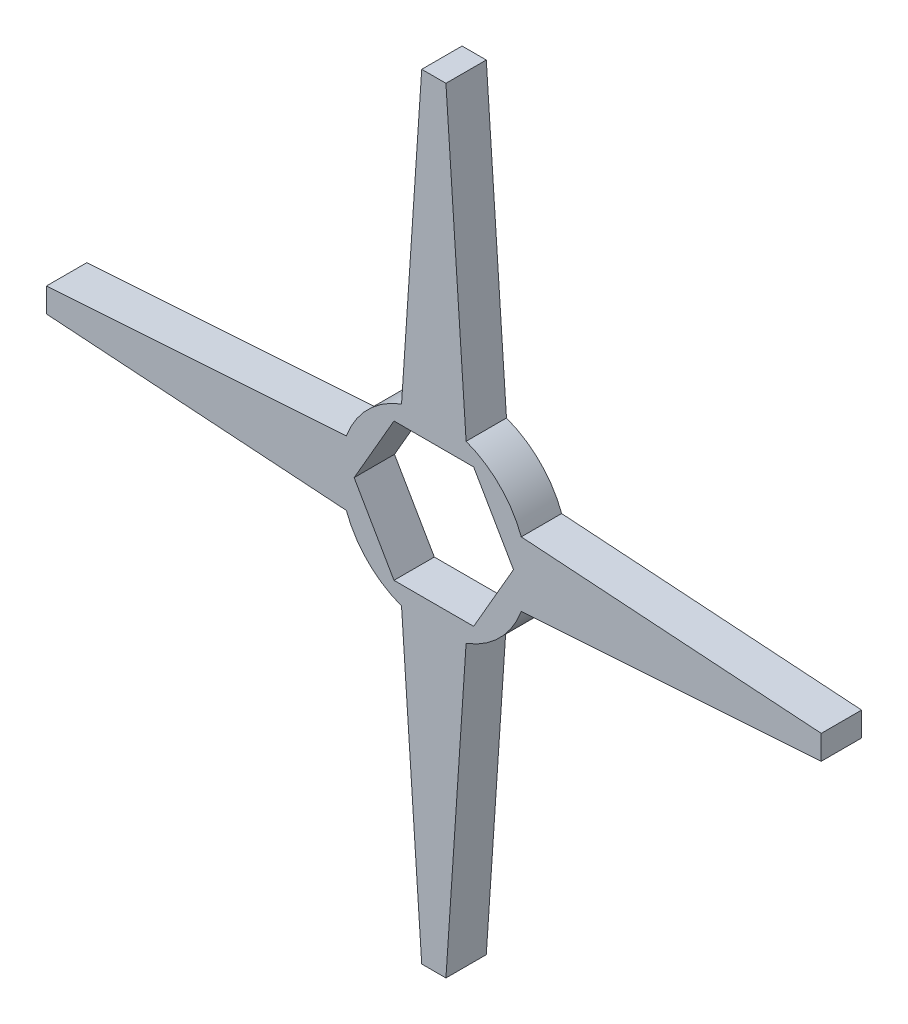
ISO-10303-21;
HEADER;
FILE_DESCRIPTION(('STEP AP214'),'2;1');
FILE_NAME('part.step','',(''),(''),'','','');
FILE_SCHEMA(('AUTOMOTIVE_DESIGN { 1 0 10303 214 1 1 1 1 }'));
ENDSEC;
DATA;
#1=APPLICATION_CONTEXT('core data for automotive mechanical design processes');
#2=APPLICATION_PROTOCOL_DEFINITION('international standard','automotive_design',2000,#1);
#3=PRODUCT_CONTEXT('',#1,'mechanical');
#4=PRODUCT('Part','Part','',(#3));
#5=PRODUCT_RELATED_PRODUCT_CATEGORY('part','',(#4));
#6=PRODUCT_DEFINITION_FORMATION('','',#4);
#7=PRODUCT_DEFINITION_CONTEXT('part definition',#1,'design');
#8=PRODUCT_DEFINITION('design','',#6,#7);
#9=PRODUCT_DEFINITION_SHAPE('','',#8);
#10=(LENGTH_UNIT() NAMED_UNIT(*) SI_UNIT(.MILLI.,.METRE.));
#11=(NAMED_UNIT(*) PLANE_ANGLE_UNIT() SI_UNIT($,.RADIAN.));
#12=(NAMED_UNIT(*) SI_UNIT($,.STERADIAN.) SOLID_ANGLE_UNIT());
#13=UNCERTAINTY_MEASURE_WITH_UNIT(LENGTH_MEASURE(1.E-05),#10,'distance_accuracy_value','');
#14=(GEOMETRIC_REPRESENTATION_CONTEXT(3) GLOBAL_UNCERTAINTY_ASSIGNED_CONTEXT((#13)) GLOBAL_UNIT_ASSIGNED_CONTEXT((#10,
#11,#12)) REPRESENTATION_CONTEXT('',''));
#15=CARTESIAN_POINT('',(0.,0.,0.));
#16=DIRECTION('',(0.,0.,1.));
#17=DIRECTION('',(1.,0.,0.));
#18=AXIS2_PLACEMENT_3D('',#15,#16,#17);
#19=CARTESIAN_POINT('',(-4.93634480157135,-8.55000000000012,5.));
#20=DIRECTION('',(0.,1.,0.));
#21=DIRECTION('',(1.00000000000001,0.,0.));
#22=AXIS2_PLACEMENT_3D('',#19,#20,#21);
#23=PLANE('',#22);
#24=DIRECTION('',(0.,0.,0.999999999999991));
#25=VECTOR('',#24,1.);
#26=CARTESIAN_POINT('',(4.93634480157164,-8.55000000000003,5.));
#27=LINE('',#26,#25);
#28=CARTESIAN_POINT('',(4.93634480157174,-8.55000000000005,0.));
#29=VERTEX_POINT('',#28);
#30=CARTESIAN_POINT('',(4.93634480157164,-8.55000000000003,5.));
#31=VERTEX_POINT('',#30);
#32=EDGE_CURVE('E11',#29,#31,#27,.T.);
#33=ORIENTED_EDGE('',*,*,#32,.F.);
#34=DIRECTION('',(-1.00000000000001,0.,0.));
#35=VECTOR('',#34,1.);
#36=CARTESIAN_POINT('',(0.,-8.55000000000014,0.));
#37=LINE('',#36,#35);
#38=CARTESIAN_POINT('',(-4.93634480157144,-8.55000000000014,0.));
#39=VERTEX_POINT('',#38);
#40=EDGE_CURVE('E151',#39,#29,#37,.F.);
#41=ORIENTED_EDGE('',*,*,#40,.F.);
#42=DIRECTION('',(0.,0.,0.999999999999991));
#43=VECTOR('',#42,1.);
#44=CARTESIAN_POINT('',(-4.93634480157135,-8.55000000000012,5.));
#45=LINE('',#44,#43);
#46=CARTESIAN_POINT('',(-4.93634480157135,-8.55000000000012,5.));
#47=VERTEX_POINT('',#46);
#48=EDGE_CURVE('E51',#39,#47,#45,.T.);
#49=ORIENTED_EDGE('',*,*,#48,.T.);
#50=DIRECTION('',(1.00000000000001,0.,0.));
#51=VECTOR('',#50,1.);
#52=CARTESIAN_POINT('',(-4.93634480157135,-8.55000000000012,5.));
#53=LINE('',#52,#51);
#54=EDGE_CURVE('E230',#47,#31,#53,.T.);
#55=ORIENTED_EDGE('',*,*,#54,.T.);
#56=EDGE_LOOP('',(#33,#41,#49,#55));
#57=FACE_BOUND('',#56,.T.);
#58=ADVANCED_FACE('F41',(#57),#23,.T.);
#59=CARTESIAN_POINT('',(-9.87268960314308,0.,5.));
#60=DIRECTION('',(0.866025403784439,0.5,0.));
#61=DIRECTION('',(0.500000000000005,-0.866025403784448,0.));
#62=AXIS2_PLACEMENT_3D('',#59,#60,#61);
#63=PLANE('',#62);
#64=ORIENTED_EDGE('',*,*,#48,.F.);
#65=DIRECTION('',(0.500000000000005,-0.866025403784448,0.));
#66=VECTOR('',#65,1.);
#67=CARTESIAN_POINT('',(-9.87268960314308,0.,1.34441069388203E-13));
#68=LINE('',#67,#66);
#69=CARTESIAN_POINT('',(-9.87268960314328,0.,0.));
#70=VERTEX_POINT('',#69);
#71=EDGE_CURVE('E169',#70,#39,#68,.T.);
#72=ORIENTED_EDGE('',*,*,#71,.F.);
#73=DIRECTION('',(0.,0.,0.999999999999991));
#74=VECTOR('',#73,1.);
#75=CARTESIAN_POINT('',(-9.87268960314308,0.,5.));
#76=LINE('',#75,#74);
#77=CARTESIAN_POINT('',(-9.87268960314308,0.,5.));
#78=VERTEX_POINT('',#77);
#79=EDGE_CURVE('E223',#70,#78,#76,.T.);
#80=ORIENTED_EDGE('',*,*,#79,.T.);
#81=DIRECTION('',(0.500000000000005,-0.866025403784448,0.));
#82=VECTOR('',#81,1.);
#83=CARTESIAN_POINT('',(-9.87268960314308,0.,5.));
#84=LINE('',#83,#82);
#85=EDGE_CURVE('E239',#78,#47,#84,.T.);
#86=ORIENTED_EDGE('',*,*,#85,.T.);
#87=EDGE_LOOP('',(#64,#72,#80,#86));
#88=FACE_BOUND('',#87,.T.);
#89=ADVANCED_FACE('F242',(#88),#63,.T.);
#90=CARTESIAN_POINT('',(-4.93634480157124,8.55000000000005,5.));
#91=DIRECTION('',(0.866025403784439,-0.5,0.));
#92=DIRECTION('',(-0.500000000000006,-0.866025403784448,0.));
#93=AXIS2_PLACEMENT_3D('',#90,#91,#92);
#94=PLANE('',#93);
#95=ORIENTED_EDGE('',*,*,#79,.F.);
#96=DIRECTION('',(-0.500000000000006,-0.866025403784448,0.));
#97=VECTOR('',#96,1.);
#98=CARTESIAN_POINT('',(-4.93634480157123,8.55000000000005,1.34441069388203E-13));
#99=LINE('',#98,#97);
#100=CARTESIAN_POINT('',(-4.93634480157133,8.55000000000006,0.));
#101=VERTEX_POINT('',#100);
#102=EDGE_CURVE('E166',#101,#70,#99,.T.);
#103=ORIENTED_EDGE('',*,*,#102,.F.);
#104=DIRECTION('',(0.,0.,0.999999999999991));
#105=VECTOR('',#104,1.);
#106=CARTESIAN_POINT('',(-4.93634480157124,8.55000000000005,5.));
#107=LINE('',#106,#105);
#108=CARTESIAN_POINT('',(-4.93634480157124,8.55000000000005,5.));
#109=VERTEX_POINT('',#108);
#110=EDGE_CURVE('E221',#101,#109,#107,.T.);
#111=ORIENTED_EDGE('',*,*,#110,.T.);
#112=DIRECTION('',(-0.500000000000006,-0.866025403784448,0.));
#113=VECTOR('',#112,1.);
#114=CARTESIAN_POINT('',(-4.93634480157124,8.55000000000005,5.));
#115=LINE('',#114,#113);
#116=EDGE_CURVE('E243',#109,#78,#115,.T.);
#117=ORIENTED_EDGE('',*,*,#116,.T.);
#118=EDGE_LOOP('',(#95,#103,#111,#117));
#119=FACE_BOUND('',#118,.T.);
#120=ADVANCED_FACE('F397',(#119),#94,.T.);
#121=CARTESIAN_POINT('',(4.9363448015713,8.55000000000004,5.));
#122=DIRECTION('',(0.,-1.,0.));
#123=DIRECTION('',(-1.00000000000001,0.,0.));
#124=AXIS2_PLACEMENT_3D('',#121,#122,#123);
#125=PLANE('',#124);
#126=ORIENTED_EDGE('',*,*,#110,.F.);
#127=DIRECTION('',(-1.00000000000001,0.,0.));
#128=VECTOR('',#127,1.);
#129=CARTESIAN_POINT('',(0.,8.55000000000006,0.));
#130=LINE('',#129,#128);
#131=CARTESIAN_POINT('',(4.9363448015714,8.55000000000006,0.));
#132=VERTEX_POINT('',#131);
#133=EDGE_CURVE('E163',#132,#101,#130,.T.);
#134=ORIENTED_EDGE('',*,*,#133,.F.);
#135=DIRECTION('',(0.,0.,0.999999999999991));
#136=VECTOR('',#135,1.);
#137=CARTESIAN_POINT('',(4.9363448015713,8.55000000000004,5.));
#138=LINE('',#137,#136);
#139=CARTESIAN_POINT('',(4.9363448015713,8.55000000000004,5.));
#140=VERTEX_POINT('',#139);
#141=EDGE_CURVE('E59',#132,#140,#138,.T.);
#142=ORIENTED_EDGE('',*,*,#141,.T.);
#143=DIRECTION('',(-1.00000000000001,0.,0.));
#144=VECTOR('',#143,1.);
#145=CARTESIAN_POINT('',(4.9363448015713,8.55000000000004,5.));
#146=LINE('',#145,#144);
#147=EDGE_CURVE('E219',#140,#109,#146,.T.);
#148=ORIENTED_EDGE('',*,*,#147,.T.);
#149=EDGE_LOOP('',(#126,#134,#142,#148));
#150=FACE_BOUND('',#149,.T.);
#151=ADVANCED_FACE('F394',(#150),#125,.T.);
#152=CARTESIAN_POINT('',(9.87268960314271,0.,5.));
#153=DIRECTION('',(-0.866025403784439,-0.5,0.));
#154=DIRECTION('',(-0.500000000000006,0.866025403784448,0.));
#155=AXIS2_PLACEMENT_3D('',#152,#153,#154);
#156=PLANE('',#155);
#157=ORIENTED_EDGE('',*,*,#141,.F.);
#158=DIRECTION('',(-0.500000000000006,0.866025403784448,0.));
#159=VECTOR('',#158,1.);
#160=CARTESIAN_POINT('',(9.87268960314271,0.,1.34441069388203E-13));
#161=LINE('',#160,#159);
#162=CARTESIAN_POINT('',(9.8726896031429,0.,0.));
#163=VERTEX_POINT('',#162);
#164=EDGE_CURVE('E149',#163,#132,#161,.T.);
#165=ORIENTED_EDGE('',*,*,#164,.F.);
#166=DIRECTION('',(0.,0.,0.999999999999991));
#167=VECTOR('',#166,1.);
#168=CARTESIAN_POINT('',(9.87268960314271,0.,5.));
#169=LINE('',#168,#167);
#170=CARTESIAN_POINT('',(9.87268960314271,0.,5.));
#171=VERTEX_POINT('',#170);
#172=EDGE_CURVE('E45',#163,#171,#169,.T.);
#173=ORIENTED_EDGE('',*,*,#172,.T.);
#174=DIRECTION('',(-0.500000000000006,0.866025403784448,0.));
#175=VECTOR('',#174,1.);
#176=CARTESIAN_POINT('',(9.87268960314271,0.,5.));
#177=LINE('',#176,#175);
#178=EDGE_CURVE('E392',#171,#140,#177,.T.);
#179=ORIENTED_EDGE('',*,*,#178,.T.);
#180=EDGE_LOOP('',(#157,#165,#173,#179));
#181=FACE_BOUND('',#180,.T.);
#182=ADVANCED_FACE('F153',(#181),#156,.T.);
#183=CARTESIAN_POINT('',(-1.49999999999983,48.0000000000004,5.));
#184=DIRECTION('',(0.,-1.,0.));
#185=DIRECTION('',(-1.00000000000001,0.,0.));
#186=AXIS2_PLACEMENT_3D('',#183,#184,#185);
#187=PLANE('',#186);
#188=DIRECTION('',(0.,0.,0.999999999999991));
#189=VECTOR('',#188,1.);
#190=CARTESIAN_POINT('',(1.50000000000006,48.0000000000004,5.));
#191=LINE('',#190,#189);
#192=CARTESIAN_POINT('',(1.50000000000009,48.0000000000005,0.));
#193=VERTEX_POINT('',#192);
#194=CARTESIAN_POINT('',(1.50000000000006,48.0000000000004,5.));
#195=VERTEX_POINT('',#194);
#196=EDGE_CURVE('E144',#193,#195,#191,.T.);
#197=ORIENTED_EDGE('',*,*,#196,.F.);
#198=DIRECTION('',(-1.00000000000001,0.,0.));
#199=VECTOR('',#198,1.);
#200=CARTESIAN_POINT('',(0.,48.0000000000005,0.));
#201=LINE('',#200,#199);
#202=CARTESIAN_POINT('',(-1.49999999999986,48.0000000000005,0.));
#203=VERTEX_POINT('',#202);
#204=EDGE_CURVE('E286',#193,#203,#201,.T.);
#205=ORIENTED_EDGE('',*,*,#204,.T.);
#206=DIRECTION('',(0.,0.,0.999999999999991));
#207=VECTOR('',#206,1.);
#208=CARTESIAN_POINT('',(-1.49999999999983,48.0000000000004,5.));
#209=LINE('',#208,#207);
#210=CARTESIAN_POINT('',(-1.49999999999983,48.0000000000004,5.));
#211=VERTEX_POINT('',#210);
#212=EDGE_CURVE('E212',#203,#211,#209,.T.);
#213=ORIENTED_EDGE('',*,*,#212,.T.);
#214=DIRECTION('',(-1.00000000000001,0.,0.));
#215=VECTOR('',#214,1.);
#216=CARTESIAN_POINT('',(-1.49999999999983,48.0000000000004,5.));
#217=LINE('',#216,#215);
#218=EDGE_CURVE('E345',#195,#211,#217,.T.);
#219=ORIENTED_EDGE('',*,*,#218,.F.);
#220=EDGE_LOOP('',(#197,#205,#213,#219));
#221=FACE_BOUND('',#220,.T.);
#222=ADVANCED_FACE('F344',(#221),#187,.F.);
#223=CARTESIAN_POINT('',(-1.49999999999983,48.0000000000004,5.));
#224=DIRECTION('',(0.99774515547767,-0.0671163521121346,0.));
#225=DIRECTION('',(-0.0671163521121352,-0.997745155477679,0.));
#226=AXIS2_PLACEMENT_3D('',#223,#224,#225);
#227=PLANE('',#226);
#228=ORIENTED_EDGE('',*,*,#212,.F.);
#229=DIRECTION('',(-0.0671163521121352,-0.997745155477679,0.));
#230=VECTOR('',#229,1.);
#231=CARTESIAN_POINT('',(-1.49999999999983,48.0000000000004,1.34441069388203E-13));
#232=LINE('',#231,#230);
#233=CARTESIAN_POINT('',(-3.99999999999992,10.8352434213532,1.36451212011646E-13));
#234=VERTEX_POINT('',#233);
#235=EDGE_CURVE('E284',#203,#234,#232,.T.);
#236=ORIENTED_EDGE('',*,*,#235,.T.);
#237=DIRECTION('',(0.,0.,0.999999999999991));
#238=VECTOR('',#237,1.);
#239=CARTESIAN_POINT('',(-4.00000000000006,10.8352434213543,5.));
#240=LINE('',#239,#238);
#241=CARTESIAN_POINT('',(-4.00000000000006,10.8352434213543,5.));
#242=VERTEX_POINT('',#241);
#243=EDGE_CURVE('E209',#234,#242,#240,.T.);
#244=ORIENTED_EDGE('',*,*,#243,.T.);
#245=DIRECTION('',(-0.0671163521121352,-0.997745155477679,0.));
#246=VECTOR('',#245,1.);
#247=CARTESIAN_POINT('',(-1.49999999999983,48.0000000000004,5.));
#248=LINE('',#247,#246);
#249=EDGE_CURVE('E351',#211,#242,#248,.T.);
#250=ORIENTED_EDGE('',*,*,#249,.F.);
#251=EDGE_LOOP('',(#228,#236,#244,#250));
#252=FACE_BOUND('',#251,.T.);
#253=ADVANCED_FACE('F355',(#252),#227,.F.);
#254=CARTESIAN_POINT('',(0.,0.,5.));
#255=DIRECTION('',(0.,0.,-0.999999999999991));
#256=DIRECTION('',(0.,1.,0.));
#257=AXIS2_PLACEMENT_3D('',#254,#255,#256);
#258=CYLINDRICAL_SURFACE('',#257,11.5499999999989);
#259=ORIENTED_EDGE('',*,*,#243,.F.);
#260=CARTESIAN_POINT('',(0.,0.,1.34441069388203E-13));
#261=DIRECTION('',(0.,0.,0.999999999999991));
#262=DIRECTION('',(0.,-1.,0.));
#263=AXIS2_PLACEMENT_3D('',#260,#261,#262);
#264=CIRCLE('',#263,11.5499999999989);
#265=CARTESIAN_POINT('',(-10.8352434213538,3.99999999999822,1.34224194791197E-13));
#266=VERTEX_POINT('',#265);
#267=EDGE_CURVE('E281',#234,#266,#264,.T.);
#268=ORIENTED_EDGE('',*,*,#267,.T.);
#269=DIRECTION('',(0.,0.,0.999999999999991));
#270=VECTOR('',#269,1.);
#271=CARTESIAN_POINT('',(-10.8352434213536,3.99999999999869,5.));
#272=LINE('',#271,#270);
#273=CARTESIAN_POINT('',(-10.8352434213536,3.99999999999869,5.));
#274=VERTEX_POINT('',#273);
#275=EDGE_CURVE('E206',#266,#274,#272,.T.);
#276=ORIENTED_EDGE('',*,*,#275,.T.);
#277=CARTESIAN_POINT('',(0.,0.,5.));
#278=DIRECTION('',(0.,0.,0.999999999999991));
#279=DIRECTION('',(-1.00000000000001,0.,0.));
#280=AXIS2_PLACEMENT_3D('',#277,#278,#279);
#281=CIRCLE('',#280,11.5499999999989);
#282=EDGE_CURVE('E356',#242,#274,#281,.T.);
#283=ORIENTED_EDGE('',*,*,#282,.F.);
#284=EDGE_LOOP('',(#259,#268,#276,#283));
#285=FACE_BOUND('',#284,.T.);
#286=ADVANCED_FACE('F454',(#285),#258,.T.);
#287=CARTESIAN_POINT('',(-48.0000000000004,1.49999999999996,5.));
#288=DIRECTION('',(0.0671163521120866,-0.997745155477673,0.));
#289=DIRECTION('',(-0.997745155477683,-0.0671163521120873,0.));
#290=AXIS2_PLACEMENT_3D('',#287,#288,#289);
#291=PLANE('',#290);
#292=ORIENTED_EDGE('',*,*,#275,.F.);
#293=DIRECTION('',(-0.997745155477683,-0.0671163521120873,0.));
#294=VECTOR('',#293,1.);
#295=CARTESIAN_POINT('',(-48.0000000000004,1.49999999999996,1.34441069388203E-13));
#296=LINE('',#295,#294);
#297=CARTESIAN_POINT('',(-48.0000000000014,1.49999999999996,0.));
#298=VERTEX_POINT('',#297);
#299=EDGE_CURVE('E278',#266,#298,#296,.T.);
#300=ORIENTED_EDGE('',*,*,#299,.T.);
#301=DIRECTION('',(0.,0.,0.999999999999991));
#302=VECTOR('',#301,1.);
#303=CARTESIAN_POINT('',(-48.0000000000004,1.49999999999996,5.));
#304=LINE('',#303,#302);
#305=CARTESIAN_POINT('',(-48.0000000000004,1.49999999999996,5.));
#306=VERTEX_POINT('',#305);
#307=EDGE_CURVE('E203',#298,#306,#304,.T.);
#308=ORIENTED_EDGE('',*,*,#307,.T.);
#309=DIRECTION('',(-0.997745155477683,-0.0671163521120873,0.));
#310=VECTOR('',#309,1.);
#311=CARTESIAN_POINT('',(-48.0000000000004,1.49999999999996,5.));
#312=LINE('',#311,#310);
#313=EDGE_CURVE('E358',#274,#306,#312,.T.);
#314=ORIENTED_EDGE('',*,*,#313,.F.);
#315=EDGE_LOOP('',(#292,#300,#308,#314));
#316=FACE_BOUND('',#315,.T.);
#317=ADVANCED_FACE('F464',(#316),#291,.F.);
#318=CARTESIAN_POINT('',(-48.0000000000003,-1.50000000000007,5.));
#319=DIRECTION('',(1.,0.,0.));
#320=DIRECTION('',(0.,-1.00000000000001,0.));
#321=AXIS2_PLACEMENT_3D('',#318,#319,#320);
#322=PLANE('',#321);
#323=ORIENTED_EDGE('',*,*,#307,.F.);
#324=DIRECTION('',(0.,1.,0.));
#325=VECTOR('',#324,1.);
#326=CARTESIAN_POINT('',(-48.0000000000014,0.,0.));
#327=LINE('',#326,#325);
#328=CARTESIAN_POINT('',(-48.0000000000013,-1.50000000000008,0.));
#329=VERTEX_POINT('',#328);
#330=EDGE_CURVE('E275',#298,#329,#327,.F.);
#331=ORIENTED_EDGE('',*,*,#330,.T.);
#332=DIRECTION('',(0.,0.,0.999999999999991));
#333=VECTOR('',#332,1.);
#334=CARTESIAN_POINT('',(-48.0000000000003,-1.50000000000007,5.));
#335=LINE('',#334,#333);
#336=CARTESIAN_POINT('',(-48.0000000000003,-1.50000000000007,5.));
#337=VERTEX_POINT('',#336);
#338=EDGE_CURVE('E200',#329,#337,#335,.T.);
#339=ORIENTED_EDGE('',*,*,#338,.T.);
#340=DIRECTION('',(0.,-1.00000000000001,0.));
#341=VECTOR('',#340,1.);
#342=CARTESIAN_POINT('',(-48.0000000000003,-1.50000000000007,5.));
#343=LINE('',#342,#341);
#344=EDGE_CURVE('E364',#306,#337,#343,.T.);
#345=ORIENTED_EDGE('',*,*,#344,.F.);
#346=EDGE_LOOP('',(#323,#331,#339,#345));
#347=FACE_BOUND('',#346,.T.);
#348=ADVANCED_FACE('F475',(#347),#322,.F.);
#349=CARTESIAN_POINT('',(-48.0000000000003,-1.50000000000007,5.));
#350=DIRECTION('',(0.0671163521121763,0.997745155477667,0.));
#351=DIRECTION('',(0.997745155477678,-0.067116352112177,0.));
#352=AXIS2_PLACEMENT_3D('',#349,#350,#351);
#353=PLANE('',#352);
#354=ORIENTED_EDGE('',*,*,#338,.F.);
#355=DIRECTION('',(0.997745155477678,-0.067116352112177,0.));
#356=VECTOR('',#355,1.);
#357=CARTESIAN_POINT('',(-48.0000000000003,-1.50000000000008,1.34441069388203E-13));
#358=LINE('',#357,#356);
#359=CARTESIAN_POINT('',(-10.8352434213525,-4.00000000000177,1.37025067784632E-13));
#360=VERTEX_POINT('',#359);
#361=EDGE_CURVE('E272',#329,#360,#358,.T.);
#362=ORIENTED_EDGE('',*,*,#361,.T.);
#363=DIRECTION('',(0.,0.,0.999999999999991));
#364=VECTOR('',#363,1.);
#365=CARTESIAN_POINT('',(-10.8352434213527,-4.0000000000018,5.));
#366=LINE('',#365,#364);
#367=CARTESIAN_POINT('',(-10.8352434213527,-4.0000000000018,5.));
#368=VERTEX_POINT('',#367);
#369=EDGE_CURVE('E197',#360,#368,#366,.T.);
#370=ORIENTED_EDGE('',*,*,#369,.T.);
#371=DIRECTION('',(0.997745155477678,-0.067116352112177,0.));
#372=VECTOR('',#371,1.);
#373=CARTESIAN_POINT('',(-48.0000000000003,-1.50000000000007,5.));
#374=LINE('',#373,#372);
#375=EDGE_CURVE('E367',#337,#368,#374,.T.);
#376=ORIENTED_EDGE('',*,*,#375,.F.);
#377=EDGE_LOOP('',(#354,#362,#370,#376));
#378=FACE_BOUND('',#377,.T.);
#379=ADVANCED_FACE('F486',(#378),#353,.F.);
#380=CARTESIAN_POINT('',(0.,0.,5.));
#381=DIRECTION('',(0.,0.,-0.999999999999991));
#382=DIRECTION('',(0.,1.,0.));
#383=AXIS2_PLACEMENT_3D('',#380,#381,#382);
#384=CYLINDRICAL_SURFACE('',#383,11.5499999999989);
#385=ORIENTED_EDGE('',*,*,#369,.F.);
#386=CARTESIAN_POINT('',(0.,0.,1.34441069388203E-13));
#387=DIRECTION('',(0.,0.,0.999999999999991));
#388=DIRECTION('',(0.,-1.,0.));
#389=AXIS2_PLACEMENT_3D('',#386,#387,#388);
#390=CIRCLE('',#389,11.5499999999989);
#391=CARTESIAN_POINT('',(-3.99999999999658,-10.8352434213545,1.31174467715438E-13));
#392=VERTEX_POINT('',#391);
#393=EDGE_CURVE('E269',#360,#392,#390,.T.);
#394=ORIENTED_EDGE('',*,*,#393,.T.);
#395=DIRECTION('',(0.,0.,0.999999999999991));
#396=VECTOR('',#395,1.);
#397=CARTESIAN_POINT('',(-3.99999999999673,-10.8352434213544,5.));
#398=LINE('',#397,#396);
#399=CARTESIAN_POINT('',(-3.99999999999673,-10.8352434213544,5.));
#400=VERTEX_POINT('',#399);
#401=EDGE_CURVE('E194',#392,#400,#398,.T.);
#402=ORIENTED_EDGE('',*,*,#401,.T.);
#403=CARTESIAN_POINT('',(0.,0.,5.));
#404=DIRECTION('',(0.,0.,0.999999999999991));
#405=DIRECTION('',(-1.00000000000001,0.,0.));
#406=AXIS2_PLACEMENT_3D('',#403,#404,#405);
#407=CIRCLE('',#406,11.5499999999989);
#408=EDGE_CURVE('E370',#368,#400,#407,.T.);
#409=ORIENTED_EDGE('',*,*,#408,.F.);
#410=EDGE_LOOP('',(#385,#394,#402,#409));
#411=FACE_BOUND('',#410,.T.);
#412=ADVANCED_FACE('F497',(#411),#384,.T.);
#413=CARTESIAN_POINT('',(-1.49999999999993,-48.0000000000004,5.));
#414=DIRECTION('',(0.997745155477676,0.0671163521120444,0.));
#415=DIRECTION('',(0.0671163521120452,-0.997745155477687,0.));
#416=AXIS2_PLACEMENT_3D('',#413,#414,#415);
#417=PLANE('',#416);
#418=ORIENTED_EDGE('',*,*,#401,.F.);
#419=DIRECTION('',(0.0671163521120452,-0.997745155477687,0.));
#420=VECTOR('',#419,1.);
#421=CARTESIAN_POINT('',(-1.49999999999993,-48.0000000000004,1.34441069388203E-13));
#422=LINE('',#421,#420);
#423=CARTESIAN_POINT('',(-1.49999999999996,-48.0000000000005,0.));
#424=VERTEX_POINT('',#423);
#425=EDGE_CURVE('E266',#392,#424,#422,.T.);
#426=ORIENTED_EDGE('',*,*,#425,.T.);
#427=DIRECTION('',(0.,0.,0.999999999999991));
#428=VECTOR('',#427,1.);
#429=CARTESIAN_POINT('',(-1.49999999999993,-48.0000000000004,5.));
#430=LINE('',#429,#428);
#431=CARTESIAN_POINT('',(-1.49999999999993,-48.0000000000004,5.));
#432=VERTEX_POINT('',#431);
#433=EDGE_CURVE('E191',#424,#432,#430,.T.);
#434=ORIENTED_EDGE('',*,*,#433,.T.);
#435=DIRECTION('',(0.0671163521120452,-0.997745155477687,0.));
#436=VECTOR('',#435,1.);
#437=CARTESIAN_POINT('',(-1.49999999999993,-48.0000000000004,5.));
#438=LINE('',#437,#436);
#439=EDGE_CURVE('E373',#400,#432,#438,.T.);
#440=ORIENTED_EDGE('',*,*,#439,.F.);
#441=EDGE_LOOP('',(#418,#426,#434,#440));
#442=FACE_BOUND('',#441,.T.);
#443=ADVANCED_FACE('F508',(#442),#417,.F.);
#444=CARTESIAN_POINT('',(1.5,-48.0000000000004,5.));
#445=DIRECTION('',(0.,1.,0.));
#446=DIRECTION('',(1.00000000000001,0.,0.));
#447=AXIS2_PLACEMENT_3D('',#444,#445,#446);
#448=PLANE('',#447);
#449=ORIENTED_EDGE('',*,*,#433,.F.);
#450=DIRECTION('',(-1.00000000000001,0.,0.));
#451=VECTOR('',#450,1.);
#452=CARTESIAN_POINT('',(0.,-48.0000000000005,0.));
#453=LINE('',#452,#451);
#454=CARTESIAN_POINT('',(1.50000000000003,-48.0000000000006,0.));
#455=VERTEX_POINT('',#454);
#456=EDGE_CURVE('E263',#424,#455,#453,.F.);
#457=ORIENTED_EDGE('',*,*,#456,.T.);
#458=DIRECTION('',(0.,0.,0.999999999999991));
#459=VECTOR('',#458,1.);
#460=CARTESIAN_POINT('',(1.5,-48.0000000000004,5.));
#461=LINE('',#460,#459);
#462=CARTESIAN_POINT('',(1.5,-48.0000000000004,5.));
#463=VERTEX_POINT('',#462);
#464=EDGE_CURVE('E188',#455,#463,#461,.T.);
#465=ORIENTED_EDGE('',*,*,#464,.T.);
#466=DIRECTION('',(1.00000000000001,0.,0.));
#467=VECTOR('',#466,1.);
#468=CARTESIAN_POINT('',(1.5,-48.0000000000004,5.));
#469=LINE('',#468,#467);
#470=EDGE_CURVE('E376',#432,#463,#469,.T.);
#471=ORIENTED_EDGE('',*,*,#470,.F.);
#472=EDGE_LOOP('',(#449,#457,#465,#471));
#473=FACE_BOUND('',#472,.T.);
#474=ADVANCED_FACE('F519',(#473),#448,.F.);
#475=CARTESIAN_POINT('',(1.5,-48.0000000000004,5.));
#476=DIRECTION('',(-0.997745155477664,0.0671163521122258,0.));
#477=DIRECTION('',(0.0671163521122265,0.997745155477674,0.));
#478=AXIS2_PLACEMENT_3D('',#475,#476,#477);
#479=PLANE('',#478);
#480=ORIENTED_EDGE('',*,*,#464,.F.);
#481=DIRECTION('',(0.0671163521122265,0.997745155477674,0.));
#482=VECTOR('',#481,1.);
#483=CARTESIAN_POINT('',(1.5,-48.0000000000004,1.34441069388203E-13));
#484=LINE('',#483,#482);
#485=CARTESIAN_POINT('',(4.00000000000345,-10.8352434213542,1.3243092676476E-13));
#486=VERTEX_POINT('',#485);
#487=EDGE_CURVE('E260',#455,#486,#484,.T.);
#488=ORIENTED_EDGE('',*,*,#487,.T.);
#489=DIRECTION('',(0.,0.,0.999999999999991));
#490=VECTOR('',#489,1.);
#491=CARTESIAN_POINT('',(4.00000000000324,-10.8352434213544,5.));
#492=LINE('',#491,#490);
#493=CARTESIAN_POINT('',(4.00000000000324,-10.8352434213544,5.));
#494=VERTEX_POINT('',#493);
#495=EDGE_CURVE('E185',#486,#494,#492,.T.);
#496=ORIENTED_EDGE('',*,*,#495,.T.);
#497=DIRECTION('',(0.0671163521122265,0.997745155477674,0.));
#498=VECTOR('',#497,1.);
#499=CARTESIAN_POINT('',(1.5,-48.0000000000004,5.));
#500=LINE('',#499,#498);
#501=EDGE_CURVE('E379',#463,#494,#500,.T.);
#502=ORIENTED_EDGE('',*,*,#501,.F.);
#503=EDGE_LOOP('',(#480,#488,#496,#502));
#504=FACE_BOUND('',#503,.T.);
#505=ADVANCED_FACE('F530',(#504),#479,.F.);
#506=CARTESIAN_POINT('',(0.,0.,5.));
#507=DIRECTION('',(0.,0.,-0.999999999999991));
#508=DIRECTION('',(0.,1.,0.));
#509=AXIS2_PLACEMENT_3D('',#506,#507,#508);
#510=CYLINDRICAL_SURFACE('',#509,11.5500000000011);
#511=ORIENTED_EDGE('',*,*,#495,.F.);
#512=CARTESIAN_POINT('',(0.,0.,1.34441069388203E-13));
#513=DIRECTION('',(0.,0.,0.999999999999991));
#514=DIRECTION('',(0.,-1.,0.));
#515=AXIS2_PLACEMENT_3D('',#512,#513,#514);
#516=CIRCLE('',#515,11.5500000000011);
#517=CARTESIAN_POINT('',(10.8352434213561,-3.99999999999838,1.34657943985208E-13));
#518=VERTEX_POINT('',#517);
#519=EDGE_CURVE('E257',#486,#518,#516,.T.);
#520=ORIENTED_EDGE('',*,*,#519,.T.);
#521=DIRECTION('',(0.,0.,0.999999999999991));
#522=VECTOR('',#521,1.);
#523=CARTESIAN_POINT('',(10.8352434213562,-3.99999999999834,5.));
#524=LINE('',#523,#522);
#525=CARTESIAN_POINT('',(10.8352434213562,-3.99999999999834,5.));
#526=VERTEX_POINT('',#525);
#527=EDGE_CURVE('E182',#518,#526,#524,.T.);
#528=ORIENTED_EDGE('',*,*,#527,.T.);
#529=CARTESIAN_POINT('',(0.,0.,5.));
#530=DIRECTION('',(0.,0.,0.999999999999991));
#531=DIRECTION('',(-1.00000000000001,0.,0.));
#532=AXIS2_PLACEMENT_3D('',#529,#530,#531);
#533=CIRCLE('',#532,11.5500000000011);
#534=EDGE_CURVE('E382',#494,#526,#533,.T.);
#535=ORIENTED_EDGE('',*,*,#534,.F.);
#536=EDGE_LOOP('',(#511,#520,#528,#535));
#537=FACE_BOUND('',#536,.T.);
#538=ADVANCED_FACE('F541',(#537),#510,.T.);
#539=CARTESIAN_POINT('',(48.0000000000002,-1.50000000000006,5.));
#540=DIRECTION('',(-0.0671163521120928,0.997745155477673,0.));
#541=DIRECTION('',(0.997745155477682,0.0671163521120934,0.));
#542=AXIS2_PLACEMENT_3D('',#539,#540,#541);
#543=PLANE('',#542);
#544=ORIENTED_EDGE('',*,*,#527,.F.);
#545=DIRECTION('',(0.997745155477682,0.0671163521120934,0.));
#546=VECTOR('',#545,1.);
#547=CARTESIAN_POINT('',(48.0000000000002,-1.50000000000006,1.34441069388203E-13));
#548=LINE('',#547,#546);
#549=CARTESIAN_POINT('',(48.0000000000012,-1.50000000000007,0.));
#550=VERTEX_POINT('',#549);
#551=EDGE_CURVE('E254',#518,#550,#548,.T.);
#552=ORIENTED_EDGE('',*,*,#551,.T.);
#553=DIRECTION('',(0.,0.,0.999999999999991));
#554=VECTOR('',#553,1.);
#555=CARTESIAN_POINT('',(48.0000000000002,-1.50000000000006,5.));
#556=LINE('',#555,#554);
#557=CARTESIAN_POINT('',(48.0000000000002,-1.50000000000006,5.));
#558=VERTEX_POINT('',#557);
#559=EDGE_CURVE('E179',#550,#558,#556,.T.);
#560=ORIENTED_EDGE('',*,*,#559,.T.);
#561=DIRECTION('',(0.997745155477682,0.0671163521120934,0.));
#562=VECTOR('',#561,1.);
#563=CARTESIAN_POINT('',(48.0000000000002,-1.50000000000006,5.));
#564=LINE('',#563,#562);
#565=EDGE_CURVE('E385',#526,#558,#564,.T.);
#566=ORIENTED_EDGE('',*,*,#565,.F.);
#567=EDGE_LOOP('',(#544,#552,#560,#566));
#568=FACE_BOUND('',#567,.T.);
#569=ADVANCED_FACE('F552',(#568),#543,.F.);
#570=CARTESIAN_POINT('',(48.0000000000004,1.49999999999999,5.));
#571=DIRECTION('',(-1.,0.,0.));
#572=DIRECTION('',(0.,1.00000000000001,0.));
#573=AXIS2_PLACEMENT_3D('',#570,#571,#572);
#574=PLANE('',#573);
#575=ORIENTED_EDGE('',*,*,#559,.F.);
#576=DIRECTION('',(0.,1.,0.));
#577=VECTOR('',#576,1.);
#578=CARTESIAN_POINT('',(48.0000000000012,0.,0.));
#579=LINE('',#578,#577);
#580=CARTESIAN_POINT('',(48.0000000000014,1.5,0.));
#581=VERTEX_POINT('',#580);
#582=EDGE_CURVE('E157',#550,#581,#579,.T.);
#583=ORIENTED_EDGE('',*,*,#582,.T.);
#584=DIRECTION('',(0.,0.,0.999999999999991));
#585=VECTOR('',#584,1.);
#586=CARTESIAN_POINT('',(48.0000000000004,1.49999999999999,5.));
#587=LINE('',#586,#585);
#588=CARTESIAN_POINT('',(48.0000000000004,1.49999999999999,5.));
#589=VERTEX_POINT('',#588);
#590=EDGE_CURVE('E175',#581,#589,#587,.T.);
#591=ORIENTED_EDGE('',*,*,#590,.T.);
#592=DIRECTION('',(0.,1.00000000000001,0.));
#593=VECTOR('',#592,1.);
#594=CARTESIAN_POINT('',(48.0000000000004,1.49999999999999,5.));
#595=LINE('',#594,#593);
#596=EDGE_CURVE('E388',#558,#589,#595,.T.);
#597=ORIENTED_EDGE('',*,*,#596,.F.);
#598=EDGE_LOOP('',(#575,#583,#591,#597));
#599=FACE_BOUND('',#598,.T.);
#600=ADVANCED_FACE('F563',(#599),#574,.F.);
#601=CARTESIAN_POINT('',(48.0000000000004,1.49999999999999,5.));
#602=DIRECTION('',(-0.0671163521121826,-0.997745155477667,0.));
#603=DIRECTION('',(-0.997745155477676,0.0671163521121833,0.));
#604=AXIS2_PLACEMENT_3D('',#601,#602,#603);
#605=PLANE('',#604);
#606=ORIENTED_EDGE('',*,*,#590,.F.);
#607=DIRECTION('',(-0.997745155477676,0.0671163521121833,0.));
#608=VECTOR('',#607,1.);
#609=CARTESIAN_POINT('',(48.0000000000004,1.49999999999999,1.34441069388203E-13));
#610=LINE('',#609,#608);
#611=CARTESIAN_POINT('',(10.8352434213548,4.00000000000177,1.31857070991773E-13));
#612=VERTEX_POINT('',#611);
#613=EDGE_CURVE('E154',#581,#612,#610,.T.);
#614=ORIENTED_EDGE('',*,*,#613,.T.);
#615=DIRECTION('',(0.,0.,0.999999999999991));
#616=VECTOR('',#615,1.);
#617=CARTESIAN_POINT('',(10.8352434213559,4.00000000000183,5.));
#618=LINE('',#617,#616);
#619=CARTESIAN_POINT('',(10.8352434213559,4.00000000000183,5.));
#620=VERTEX_POINT('',#619);
#621=EDGE_CURVE('E172',#612,#620,#618,.T.);
#622=ORIENTED_EDGE('',*,*,#621,.T.);
#623=DIRECTION('',(-0.997745155477676,0.0671163521121833,0.));
#624=VECTOR('',#623,1.);
#625=CARTESIAN_POINT('',(48.0000000000004,1.49999999999999,5.));
#626=LINE('',#625,#624);
#627=EDGE_CURVE('E311',#589,#620,#626,.T.);
#628=ORIENTED_EDGE('',*,*,#627,.F.);
#629=EDGE_LOOP('',(#606,#614,#622,#628));
#630=FACE_BOUND('',#629,.T.);
#631=ADVANCED_FACE('F309',(#630),#605,.F.);
#632=CARTESIAN_POINT('',(0.,0.,5.));
#633=DIRECTION('',(0.,0.,-0.999999999999991));
#634=DIRECTION('',(0.,1.,0.));
#635=AXIS2_PLACEMENT_3D('',#632,#633,#634);
#636=CYLINDRICAL_SURFACE('',#635,11.5500000000011);
#637=ORIENTED_EDGE('',*,*,#621,.F.);
#638=CARTESIAN_POINT('',(0.,0.,1.34441069388203E-13));
#639=DIRECTION('',(0.,0.,0.999999999999991));
#640=DIRECTION('',(0.,-1.,0.));
#641=AXIS2_PLACEMENT_3D('',#638,#639,#640);
#642=CIRCLE('',#641,11.5500000000011);
#643=CARTESIAN_POINT('',(4.00000000000001,10.8352434213555,1.37707671060967E-13));
#644=VERTEX_POINT('',#643);
#645=EDGE_CURVE('E249',#612,#644,#642,.T.);
#646=ORIENTED_EDGE('',*,*,#645,.T.);
#647=DIRECTION('',(0.,0.,0.999999999999991));
#648=VECTOR('',#647,1.);
#649=CARTESIAN_POINT('',(4.00000000000007,10.8352434213543,5.));
#650=LINE('',#649,#648);
#651=CARTESIAN_POINT('',(4.00000000000007,10.8352434213543,5.));
#652=VERTEX_POINT('',#651);
#653=EDGE_CURVE('E176',#644,#652,#650,.T.);
#654=ORIENTED_EDGE('',*,*,#653,.T.);
#655=CARTESIAN_POINT('',(0.,0.,5.));
#656=DIRECTION('',(0.,0.,0.999999999999991));
#657=DIRECTION('',(-1.00000000000001,0.,0.));
#658=AXIS2_PLACEMENT_3D('',#655,#656,#657);
#659=CIRCLE('',#658,11.5500000000011);
#660=EDGE_CURVE('E165',#620,#652,#659,.T.);
#661=ORIENTED_EDGE('',*,*,#660,.F.);
#662=EDGE_LOOP('',(#637,#646,#654,#661));
#663=FACE_BOUND('',#662,.T.);
#664=ADVANCED_FACE('F302',(#663),#636,.T.);
#665=CARTESIAN_POINT('',(1.50000000000006,48.0000000000004,5.));
#666=DIRECTION('',(-0.99774515547767,-0.067116352112135,0.));
#667=DIRECTION('',(-0.0671163521121356,0.99774515547768,0.));
#668=AXIS2_PLACEMENT_3D('',#665,#666,#667);
#669=PLANE('',#668);
#670=DIRECTION('',(-0.0671163521121356,0.99774515547768,0.));
#671=VECTOR('',#670,1.);
#672=CARTESIAN_POINT('',(1.50000000000006,48.0000000000004,1.34441069388203E-13));
#673=LINE('',#672,#671);
#674=EDGE_CURVE('E161',#644,#193,#673,.T.);
#675=ORIENTED_EDGE('',*,*,#674,.T.);
#676=ORIENTED_EDGE('',*,*,#196,.T.);
#677=DIRECTION('',(-0.0671163521121356,0.99774515547768,0.));
#678=VECTOR('',#677,1.);
#679=CARTESIAN_POINT('',(1.50000000000006,48.0000000000004,5.));
#680=LINE('',#679,#678);
#681=EDGE_CURVE('E353',#652,#195,#680,.T.);
#682=ORIENTED_EDGE('',*,*,#681,.F.);
#683=ORIENTED_EDGE('',*,*,#653,.F.);
#684=EDGE_LOOP('',(#675,#676,#682,#683));
#685=FACE_BOUND('',#684,.T.);
#686=ADVANCED_FACE('F293',(#685),#669,.F.);
#687=CARTESIAN_POINT('',(4.93634480157164,-8.55000000000003,5.));
#688=DIRECTION('',(-0.866025403784439,0.5,0.));
#689=DIRECTION('',(0.500000000000005,0.866025403784448,0.));
#690=AXIS2_PLACEMENT_3D('',#687,#688,#689);
#691=PLANE('',#690);
#692=DIRECTION('',(0.500000000000005,0.866025403784448,0.));
#693=VECTOR('',#692,1.);
#694=CARTESIAN_POINT('',(4.93634480157164,-8.55000000000003,1.34441069388203E-13));
#695=LINE('',#694,#693);
#696=EDGE_CURVE('E137',#29,#163,#695,.T.);
#697=ORIENTED_EDGE('',*,*,#696,.F.);
#698=ORIENTED_EDGE('',*,*,#32,.T.);
#699=DIRECTION('',(0.500000000000005,0.866025403784448,0.));
#700=VECTOR('',#699,1.);
#701=CARTESIAN_POINT('',(4.93634480157164,-8.55000000000003,5.));
#702=LINE('',#701,#700);
#703=EDGE_CURVE('E140',#31,#171,#702,.T.);
#704=ORIENTED_EDGE('',*,*,#703,.T.);
#705=ORIENTED_EDGE('',*,*,#172,.F.);
#706=EDGE_LOOP('',(#697,#698,#704,#705));
#707=FACE_BOUND('',#706,.T.);
#708=ADVANCED_FACE('F43',(#707),#691,.T.);
#709=CARTESIAN_POINT('',(0.,0.,5.));
#710=DIRECTION('',(0.,0.,-0.999999999999991));
#711=DIRECTION('',(-1.00000000000001,0.,0.));
#712=AXIS2_PLACEMENT_3D('',#709,#710,#711);
#713=PLANE('',#712);
#714=ORIENTED_EDGE('',*,*,#660,.T.);
#715=ORIENTED_EDGE('',*,*,#681,.T.);
#716=ORIENTED_EDGE('',*,*,#218,.T.);
#717=ORIENTED_EDGE('',*,*,#249,.T.);
#718=ORIENTED_EDGE('',*,*,#282,.T.);
#719=ORIENTED_EDGE('',*,*,#313,.T.);
#720=ORIENTED_EDGE('',*,*,#344,.T.);
#721=ORIENTED_EDGE('',*,*,#375,.T.);
#722=ORIENTED_EDGE('',*,*,#408,.T.);
#723=ORIENTED_EDGE('',*,*,#439,.T.);
#724=ORIENTED_EDGE('',*,*,#470,.T.);
#725=ORIENTED_EDGE('',*,*,#501,.T.);
#726=ORIENTED_EDGE('',*,*,#534,.T.);
#727=ORIENTED_EDGE('',*,*,#565,.T.);
#728=ORIENTED_EDGE('',*,*,#596,.T.);
#729=ORIENTED_EDGE('',*,*,#627,.T.);
#730=EDGE_LOOP('',(#714,#715,#716,#717,#718,#719,#720,#721,#722,#723,#724,#725,#726,#727,#728,#729));
#731=FACE_BOUND('',#730,.T.);
#732=ORIENTED_EDGE('',*,*,#178,.F.);
#733=ORIENTED_EDGE('',*,*,#703,.F.);
#734=ORIENTED_EDGE('',*,*,#54,.F.);
#735=ORIENTED_EDGE('',*,*,#85,.F.);
#736=ORIENTED_EDGE('',*,*,#116,.F.);
#737=ORIENTED_EDGE('',*,*,#147,.F.);
#738=EDGE_LOOP('',(#732,#733,#734,#735,#736,#737));
#739=FACE_BOUND('',#738,.T.);
#740=ADVANCED_FACE('F237',(#731,#739),#713,.F.);
#741=CARTESIAN_POINT('',(0.,0.,0.));
#742=DIRECTION('',(0.,0.,-0.999999999999991));
#743=DIRECTION('',(-1.00000000000001,0.,0.));
#744=AXIS2_PLACEMENT_3D('',#741,#742,#743);
#745=PLANE('',#744);
#746=ORIENTED_EDGE('',*,*,#645,.F.);
#747=ORIENTED_EDGE('',*,*,#613,.F.);
#748=ORIENTED_EDGE('',*,*,#582,.F.);
#749=ORIENTED_EDGE('',*,*,#551,.F.);
#750=ORIENTED_EDGE('',*,*,#519,.F.);
#751=ORIENTED_EDGE('',*,*,#487,.F.);
#752=ORIENTED_EDGE('',*,*,#456,.F.);
#753=ORIENTED_EDGE('',*,*,#425,.F.);
#754=ORIENTED_EDGE('',*,*,#393,.F.);
#755=ORIENTED_EDGE('',*,*,#361,.F.);
#756=ORIENTED_EDGE('',*,*,#330,.F.);
#757=ORIENTED_EDGE('',*,*,#299,.F.);
#758=ORIENTED_EDGE('',*,*,#267,.F.);
#759=ORIENTED_EDGE('',*,*,#235,.F.);
#760=ORIENTED_EDGE('',*,*,#204,.F.);
#761=ORIENTED_EDGE('',*,*,#674,.F.);
#762=EDGE_LOOP('',(#746,#747,#748,#749,#750,#751,#752,#753,#754,#755,#756,#757,#758,#759,#760,#761));
#763=FACE_BOUND('',#762,.T.);
#764=ORIENTED_EDGE('',*,*,#164,.T.);
#765=ORIENTED_EDGE('',*,*,#133,.T.);
#766=ORIENTED_EDGE('',*,*,#102,.T.);
#767=ORIENTED_EDGE('',*,*,#71,.T.);
#768=ORIENTED_EDGE('',*,*,#40,.T.);
#769=ORIENTED_EDGE('',*,*,#696,.T.);
#770=EDGE_LOOP('',(#764,#765,#766,#767,#768,#769));
#771=FACE_BOUND('',#770,.T.);
#772=ADVANCED_FACE('F147',(#763,#771),#745,.T.);
#773=CLOSED_SHELL('',(#58,#89,#120,#151,#182,#222,#253,#286,#317,#348,#379,#412,#443,#474,#505,
#538,#569,#600,#631,#664,#686,#708,#740,#772));
#774=MANIFOLD_SOLID_BREP('B2',#773);
#775=ADVANCED_BREP_SHAPE_REPRESENTATION('',(#18,#774),#14);
#776=SHAPE_DEFINITION_REPRESENTATION(#9,#775);
ENDSEC;
END-ISO-10303-21;
